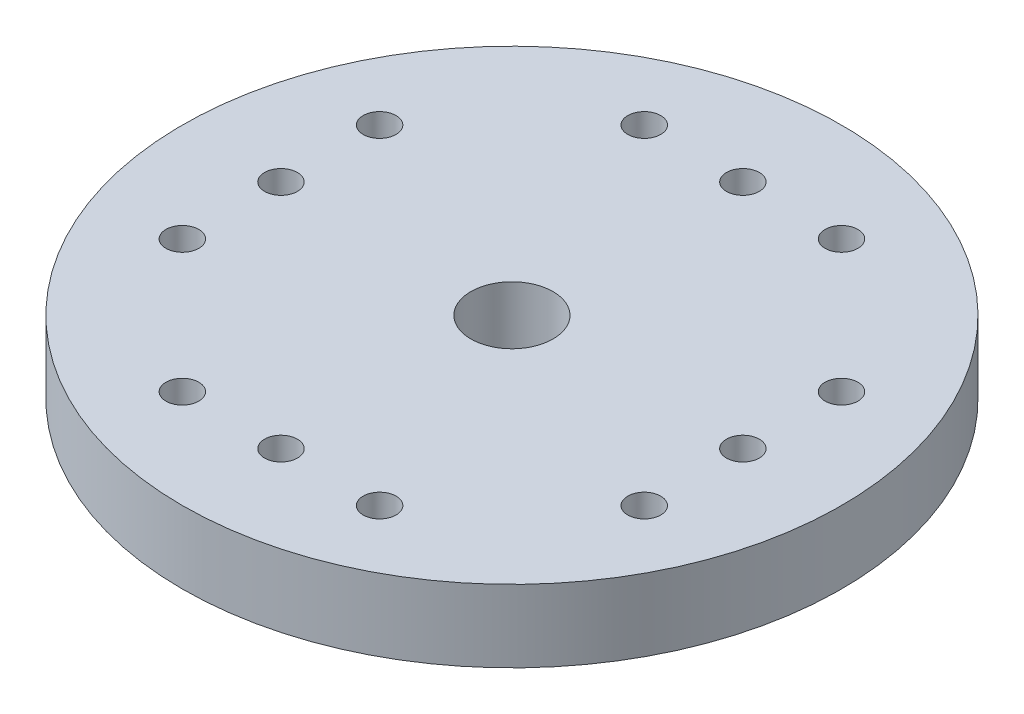
ISO-10303-21;
HEADER;
FILE_DESCRIPTION(('STEP AP214'),'2;1');
FILE_NAME('part.step','',(''),(''),'','','');
FILE_SCHEMA(('AUTOMOTIVE_DESIGN { 1 0 10303 214 1 1 1 1 }'));
ENDSEC;
DATA;
#1=APPLICATION_CONTEXT('core data for automotive mechanical design processes');
#2=APPLICATION_PROTOCOL_DEFINITION('international standard','automotive_design',2000,#1);
#3=PRODUCT_CONTEXT('',#1,'mechanical');
#4=PRODUCT('Part','Part','',(#3));
#5=PRODUCT_RELATED_PRODUCT_CATEGORY('part','',(#4));
#6=PRODUCT_DEFINITION_FORMATION('','',#4);
#7=PRODUCT_DEFINITION_CONTEXT('part definition',#1,'design');
#8=PRODUCT_DEFINITION('design','',#6,#7);
#9=PRODUCT_DEFINITION_SHAPE('','',#8);
#10=(LENGTH_UNIT() NAMED_UNIT(*) SI_UNIT(.MILLI.,.METRE.));
#11=(NAMED_UNIT(*) PLANE_ANGLE_UNIT() SI_UNIT($,.RADIAN.));
#12=(NAMED_UNIT(*) SI_UNIT($,.STERADIAN.) SOLID_ANGLE_UNIT());
#13=UNCERTAINTY_MEASURE_WITH_UNIT(LENGTH_MEASURE(1.E-05),#10,'distance_accuracy_value','');
#14=(GEOMETRIC_REPRESENTATION_CONTEXT(3) GLOBAL_UNCERTAINTY_ASSIGNED_CONTEXT((#13)) GLOBAL_UNIT_ASSIGNED_CONTEXT((#10,
#11,#12)) REPRESENTATION_CONTEXT('',''));
#15=CARTESIAN_POINT('',(0.,0.,0.));
#16=DIRECTION('',(0.,0.,1.));
#17=DIRECTION('',(1.,0.,0.));
#18=AXIS2_PLACEMENT_3D('',#15,#16,#17);
#19=CARTESIAN_POINT('',(0.,2.2,0.));
#20=DIRECTION('',(0.,-1.,0.));
#21=DIRECTION('',(0.,0.,-1.));
#22=AXIS2_PLACEMENT_3D('',#19,#20,#21);
#23=CYLINDRICAL_SURFACE('',#22,10.025);
#24=CARTESIAN_POINT('',(0.,2.2,0.));
#25=DIRECTION('',(0.,1.,0.));
#26=DIRECTION('',(0.,0.,1.));
#27=AXIS2_PLACEMENT_3D('',#24,#25,#26);
#28=CIRCLE('',#27,10.025);
#29=CARTESIAN_POINT('',(0.,2.2,10.025));
#30=VERTEX_POINT('',#29);
#31=EDGE_CURVE('E44',#30,#30,#28,.T.);
#32=ORIENTED_EDGE('',*,*,#31,.F.);
#33=EDGE_LOOP('',(#32));
#34=FACE_BOUND('',#33,.T.);
#35=CARTESIAN_POINT('',(0.,0.,0.));
#36=DIRECTION('',(0.,1.,0.));
#37=DIRECTION('',(0.,0.,1.));
#38=AXIS2_PLACEMENT_3D('',#35,#36,#37);
#39=CIRCLE('',#38,10.025);
#40=CARTESIAN_POINT('',(0.,0.,10.025));
#41=VERTEX_POINT('',#40);
#42=EDGE_CURVE('E48',#41,#41,#39,.T.);
#43=ORIENTED_EDGE('',*,*,#42,.T.);
#44=EDGE_LOOP('',(#43));
#45=FACE_BOUND('',#44,.T.);
#46=ADVANCED_FACE('F38',(#34,#45),#23,.T.);
#47=CARTESIAN_POINT('',(0.,2.2,0.));
#48=DIRECTION('',(0.,1.,0.));
#49=DIRECTION('',(0.,0.,1.));
#50=AXIS2_PLACEMENT_3D('',#47,#48,#49);
#51=PLANE('',#50);
#52=CARTESIAN_POINT('',(0.,2.2,0.));
#53=DIRECTION('',(0.,-1.,0.));
#54=DIRECTION('',(0.,0.,-1.));
#55=AXIS2_PLACEMENT_3D('',#52,#53,#54);
#56=CIRCLE('',#55,1.25);
#57=CARTESIAN_POINT('',(0.,2.2,-1.25));
#58=VERTEX_POINT('',#57);
#59=EDGE_CURVE('E133',#58,#58,#56,.T.);
#60=ORIENTED_EDGE('',*,*,#59,.T.);
#61=EDGE_LOOP('',(#60));
#62=FACE_BOUND('',#61,.T.);
#63=CARTESIAN_POINT('',(-3.00000000000007,2.2,-7.02499999999997));
#64=DIRECTION('',(0.,-1.,0.));
#65=DIRECTION('',(0.,0.,-1.));
#66=AXIS2_PLACEMENT_3D('',#63,#64,#65);
#67=CIRCLE('',#66,0.5);
#68=CARTESIAN_POINT('',(-3.00000000000007,2.2,-7.52499999999997));
#69=VERTEX_POINT('',#68);
#70=EDGE_CURVE('E64',#69,#69,#67,.T.);
#71=ORIENTED_EDGE('',*,*,#70,.T.);
#72=EDGE_LOOP('',(#71));
#73=FACE_BOUND('',#72,.T.);
#74=CARTESIAN_POINT('',(0.,2.2,-7.025));
#75=DIRECTION('',(0.,-1.,0.));
#76=DIRECTION('',(0.,0.,-1.));
#77=AXIS2_PLACEMENT_3D('',#74,#75,#76);
#78=CIRCLE('',#77,0.5);
#79=CARTESIAN_POINT('',(0.,2.2,-7.525));
#80=VERTEX_POINT('',#79);
#81=EDGE_CURVE('E71',#80,#80,#78,.T.);
#82=ORIENTED_EDGE('',*,*,#81,.T.);
#83=EDGE_LOOP('',(#82));
#84=FACE_BOUND('',#83,.T.);
#85=CARTESIAN_POINT('',(2.99999999999993,2.2,-7.02500000000003));
#86=DIRECTION('',(0.,-1.,0.));
#87=DIRECTION('',(0.,0.,-1.));
#88=AXIS2_PLACEMENT_3D('',#85,#86,#87);
#89=CIRCLE('',#88,0.5);
#90=CARTESIAN_POINT('',(2.99999999999993,2.2,-7.52500000000003));
#91=VERTEX_POINT('',#90);
#92=EDGE_CURVE('E77',#91,#91,#89,.T.);
#93=ORIENTED_EDGE('',*,*,#92,.T.);
#94=EDGE_LOOP('',(#93));
#95=FACE_BOUND('',#94,.T.);
#96=CARTESIAN_POINT('',(7.02499999999998,2.2,-3.00000000000005));
#97=DIRECTION('',(0.,-1.,0.));
#98=DIRECTION('',(0.,0.,-1.));
#99=AXIS2_PLACEMENT_3D('',#96,#97,#98);
#100=CIRCLE('',#99,0.500000000000001);
#101=CARTESIAN_POINT('',(7.02499999999998,2.2,-3.50000000000005));
#102=VERTEX_POINT('',#101);
#103=EDGE_CURVE('E83',#102,#102,#100,.T.);
#104=ORIENTED_EDGE('',*,*,#103,.T.);
#105=EDGE_LOOP('',(#104));
#106=FACE_BOUND('',#105,.T.);
#107=CARTESIAN_POINT('',(7.025,2.2,0.));
#108=DIRECTION('',(0.,-1.,0.));
#109=DIRECTION('',(0.,0.,-1.));
#110=AXIS2_PLACEMENT_3D('',#107,#108,#109);
#111=CIRCLE('',#110,0.5);
#112=CARTESIAN_POINT('',(7.025,2.2,-0.500000000000048));
#113=VERTEX_POINT('',#112);
#114=EDGE_CURVE('E89',#113,#113,#111,.T.);
#115=ORIENTED_EDGE('',*,*,#114,.T.);
#116=EDGE_LOOP('',(#115));
#117=FACE_BOUND('',#116,.T.);
#118=CARTESIAN_POINT('',(7.02500000000002,2.2,2.99999999999995));
#119=DIRECTION('',(0.,-1.,0.));
#120=DIRECTION('',(0.,0.,-1.));
#121=AXIS2_PLACEMENT_3D('',#118,#119,#120);
#122=CIRCLE('',#121,0.5);
#123=CARTESIAN_POINT('',(7.02500000000002,2.2,2.49999999999995));
#124=VERTEX_POINT('',#123);
#125=EDGE_CURVE('E95',#124,#124,#122,.T.);
#126=ORIENTED_EDGE('',*,*,#125,.T.);
#127=EDGE_LOOP('',(#126));
#128=FACE_BOUND('',#127,.T.);
#129=CARTESIAN_POINT('',(3.00000000000003,2.2,7.02499999999999));
#130=DIRECTION('',(0.,-1.,0.));
#131=DIRECTION('',(0.,0.,-1.));
#132=AXIS2_PLACEMENT_3D('',#129,#130,#131);
#133=CIRCLE('',#132,0.5);
#134=CARTESIAN_POINT('',(3.00000000000003,2.2,6.52499999999999));
#135=VERTEX_POINT('',#134);
#136=EDGE_CURVE('E101',#135,#135,#133,.T.);
#137=ORIENTED_EDGE('',*,*,#136,.T.);
#138=EDGE_LOOP('',(#137));
#139=FACE_BOUND('',#138,.T.);
#140=CARTESIAN_POINT('',(0.,2.2,7.025));
#141=DIRECTION('',(0.,-1.,0.));
#142=DIRECTION('',(0.,0.,-1.));
#143=AXIS2_PLACEMENT_3D('',#140,#141,#142);
#144=CIRCLE('',#143,0.5);
#145=CARTESIAN_POINT('',(0.,2.2,6.525));
#146=VERTEX_POINT('',#145);
#147=EDGE_CURVE('E107',#146,#146,#144,.T.);
#148=ORIENTED_EDGE('',*,*,#147,.T.);
#149=EDGE_LOOP('',(#148));
#150=FACE_BOUND('',#149,.T.);
#151=CARTESIAN_POINT('',(-2.99999999999998,2.2,7.02500000000001));
#152=DIRECTION('',(0.,-1.,0.));
#153=DIRECTION('',(0.,0.,-1.));
#154=AXIS2_PLACEMENT_3D('',#151,#152,#153);
#155=CIRCLE('',#154,0.5);
#156=CARTESIAN_POINT('',(-2.99999999999998,2.2,6.52500000000001));
#157=VERTEX_POINT('',#156);
#158=EDGE_CURVE('E113',#157,#157,#155,.T.);
#159=ORIENTED_EDGE('',*,*,#158,.T.);
#160=EDGE_LOOP('',(#159));
#161=FACE_BOUND('',#160,.T.);
#162=CARTESIAN_POINT('',(-7.025,2.2,3.));
#163=DIRECTION('',(0.,-1.,0.));
#164=DIRECTION('',(0.,0.,-1.));
#165=AXIS2_PLACEMENT_3D('',#162,#163,#164);
#166=CIRCLE('',#165,0.500000000000001);
#167=CARTESIAN_POINT('',(-7.025,2.2,2.5));
#168=VERTEX_POINT('',#167);
#169=EDGE_CURVE('E119',#168,#168,#166,.T.);
#170=ORIENTED_EDGE('',*,*,#169,.T.);
#171=EDGE_LOOP('',(#170));
#172=FACE_BOUND('',#171,.T.);
#173=CARTESIAN_POINT('',(-7.025,2.2,0.));
#174=DIRECTION('',(0.,-1.,0.));
#175=DIRECTION('',(0.,0.,-1.));
#176=AXIS2_PLACEMENT_3D('',#173,#174,#175);
#177=CIRCLE('',#176,0.5);
#178=CARTESIAN_POINT('',(-7.025,2.2,-0.5));
#179=VERTEX_POINT('',#178);
#180=EDGE_CURVE('E58',#179,#179,#177,.T.);
#181=ORIENTED_EDGE('',*,*,#180,.T.);
#182=EDGE_LOOP('',(#181));
#183=FACE_BOUND('',#182,.T.);
#184=CARTESIAN_POINT('',(-7.025,2.2,-3.));
#185=DIRECTION('',(0.,-1.,0.));
#186=DIRECTION('',(0.,0.,-1.));
#187=AXIS2_PLACEMENT_3D('',#184,#185,#186);
#188=CIRCLE('',#187,0.5);
#189=CARTESIAN_POINT('',(-7.025,2.2,-3.5));
#190=VERTEX_POINT('',#189);
#191=EDGE_CURVE('E53',#190,#190,#188,.T.);
#192=ORIENTED_EDGE('',*,*,#191,.T.);
#193=EDGE_LOOP('',(#192));
#194=FACE_BOUND('',#193,.T.);
#195=ORIENTED_EDGE('',*,*,#31,.T.);
#196=EDGE_LOOP('',(#195));
#197=FACE_BOUND('',#196,.T.);
#198=ADVANCED_FACE('F142',(#62,#73,#84,#95,#106,#117,#128,#139,#150,#161,#172,#183,#194,#197),
#51,.T.);
#199=CARTESIAN_POINT('',(0.,0.,0.));
#200=DIRECTION('',(0.,1.,0.));
#201=DIRECTION('',(0.,0.,1.));
#202=AXIS2_PLACEMENT_3D('',#199,#200,#201);
#203=PLANE('',#202);
#204=CARTESIAN_POINT('',(0.,0.,0.));
#205=DIRECTION('',(0.,1.,0.));
#206=DIRECTION('',(0.,0.,1.));
#207=AXIS2_PLACEMENT_3D('',#204,#205,#206);
#208=CIRCLE('',#207,3.8);
#209=CARTESIAN_POINT('',(0.,0.,3.8));
#210=VERTEX_POINT('',#209);
#211=EDGE_CURVE('E10',#210,#210,#208,.F.);
#212=ORIENTED_EDGE('',*,*,#211,.F.);
#213=EDGE_LOOP('',(#212));
#214=FACE_BOUND('',#213,.T.);
#215=CARTESIAN_POINT('',(-3.00000000000007,0.,-7.02499999999997));
#216=DIRECTION('',(0.,-1.,0.));
#217=DIRECTION('',(0.,0.,-1.));
#218=AXIS2_PLACEMENT_3D('',#215,#216,#217);
#219=CIRCLE('',#218,0.5);
#220=CARTESIAN_POINT('',(-3.00000000000007,0.,-7.52499999999997));
#221=VERTEX_POINT('',#220);
#222=EDGE_CURVE('E61',#221,#221,#219,.T.);
#223=ORIENTED_EDGE('',*,*,#222,.F.);
#224=EDGE_LOOP('',(#223));
#225=FACE_BOUND('',#224,.T.);
#226=CARTESIAN_POINT('',(0.,0.,-7.025));
#227=DIRECTION('',(0.,-1.,0.));
#228=DIRECTION('',(0.,0.,-1.));
#229=AXIS2_PLACEMENT_3D('',#226,#227,#228);
#230=CIRCLE('',#229,0.5);
#231=CARTESIAN_POINT('',(0.,0.,-7.525));
#232=VERTEX_POINT('',#231);
#233=EDGE_CURVE('E68',#232,#232,#230,.T.);
#234=ORIENTED_EDGE('',*,*,#233,.F.);
#235=EDGE_LOOP('',(#234));
#236=FACE_BOUND('',#235,.T.);
#237=CARTESIAN_POINT('',(2.99999999999993,0.,-7.02500000000003));
#238=DIRECTION('',(0.,-1.,0.));
#239=DIRECTION('',(0.,0.,-1.));
#240=AXIS2_PLACEMENT_3D('',#237,#238,#239);
#241=CIRCLE('',#240,0.5);
#242=CARTESIAN_POINT('',(2.99999999999993,0.,-7.52500000000003));
#243=VERTEX_POINT('',#242);
#244=EDGE_CURVE('E74',#243,#243,#241,.T.);
#245=ORIENTED_EDGE('',*,*,#244,.F.);
#246=EDGE_LOOP('',(#245));
#247=FACE_BOUND('',#246,.T.);
#248=CARTESIAN_POINT('',(7.02499999999998,0.,-3.00000000000005));
#249=DIRECTION('',(0.,-1.,0.));
#250=DIRECTION('',(0.,0.,-1.));
#251=AXIS2_PLACEMENT_3D('',#248,#249,#250);
#252=CIRCLE('',#251,0.500000000000001);
#253=CARTESIAN_POINT('',(7.02499999999998,0.,-3.50000000000005));
#254=VERTEX_POINT('',#253);
#255=EDGE_CURVE('E80',#254,#254,#252,.T.);
#256=ORIENTED_EDGE('',*,*,#255,.F.);
#257=EDGE_LOOP('',(#256));
#258=FACE_BOUND('',#257,.T.);
#259=CARTESIAN_POINT('',(7.025,0.,0.));
#260=DIRECTION('',(0.,-1.,0.));
#261=DIRECTION('',(0.,0.,-1.));
#262=AXIS2_PLACEMENT_3D('',#259,#260,#261);
#263=CIRCLE('',#262,0.5);
#264=CARTESIAN_POINT('',(7.025,0.,-0.500000000000048));
#265=VERTEX_POINT('',#264);
#266=EDGE_CURVE('E86',#265,#265,#263,.T.);
#267=ORIENTED_EDGE('',*,*,#266,.F.);
#268=EDGE_LOOP('',(#267));
#269=FACE_BOUND('',#268,.T.);
#270=CARTESIAN_POINT('',(7.02500000000002,0.,2.99999999999995));
#271=DIRECTION('',(0.,-1.,0.));
#272=DIRECTION('',(0.,0.,-1.));
#273=AXIS2_PLACEMENT_3D('',#270,#271,#272);
#274=CIRCLE('',#273,0.5);
#275=CARTESIAN_POINT('',(7.02500000000002,0.,2.49999999999995));
#276=VERTEX_POINT('',#275);
#277=EDGE_CURVE('E92',#276,#276,#274,.T.);
#278=ORIENTED_EDGE('',*,*,#277,.F.);
#279=EDGE_LOOP('',(#278));
#280=FACE_BOUND('',#279,.T.);
#281=CARTESIAN_POINT('',(3.00000000000003,0.,7.02499999999999));
#282=DIRECTION('',(0.,-1.,0.));
#283=DIRECTION('',(0.,0.,-1.));
#284=AXIS2_PLACEMENT_3D('',#281,#282,#283);
#285=CIRCLE('',#284,0.5);
#286=CARTESIAN_POINT('',(3.00000000000003,0.,6.52499999999999));
#287=VERTEX_POINT('',#286);
#288=EDGE_CURVE('E98',#287,#287,#285,.T.);
#289=ORIENTED_EDGE('',*,*,#288,.F.);
#290=EDGE_LOOP('',(#289));
#291=FACE_BOUND('',#290,.T.);
#292=CARTESIAN_POINT('',(0.,0.,7.025));
#293=DIRECTION('',(0.,-1.,0.));
#294=DIRECTION('',(0.,0.,-1.));
#295=AXIS2_PLACEMENT_3D('',#292,#293,#294);
#296=CIRCLE('',#295,0.5);
#297=CARTESIAN_POINT('',(0.,0.,6.525));
#298=VERTEX_POINT('',#297);
#299=EDGE_CURVE('E104',#298,#298,#296,.T.);
#300=ORIENTED_EDGE('',*,*,#299,.F.);
#301=EDGE_LOOP('',(#300));
#302=FACE_BOUND('',#301,.T.);
#303=CARTESIAN_POINT('',(-2.99999999999998,0.,7.02500000000001));
#304=DIRECTION('',(0.,-1.,0.));
#305=DIRECTION('',(0.,0.,-1.));
#306=AXIS2_PLACEMENT_3D('',#303,#304,#305);
#307=CIRCLE('',#306,0.5);
#308=CARTESIAN_POINT('',(-2.99999999999998,0.,6.52500000000001));
#309=VERTEX_POINT('',#308);
#310=EDGE_CURVE('E110',#309,#309,#307,.T.);
#311=ORIENTED_EDGE('',*,*,#310,.F.);
#312=EDGE_LOOP('',(#311));
#313=FACE_BOUND('',#312,.T.);
#314=CARTESIAN_POINT('',(-7.025,0.,3.));
#315=DIRECTION('',(0.,-1.,0.));
#316=DIRECTION('',(0.,0.,-1.));
#317=AXIS2_PLACEMENT_3D('',#314,#315,#316);
#318=CIRCLE('',#317,0.500000000000001);
#319=CARTESIAN_POINT('',(-7.025,0.,2.5));
#320=VERTEX_POINT('',#319);
#321=EDGE_CURVE('E116',#320,#320,#318,.T.);
#322=ORIENTED_EDGE('',*,*,#321,.F.);
#323=EDGE_LOOP('',(#322));
#324=FACE_BOUND('',#323,.T.);
#325=CARTESIAN_POINT('',(-7.025,0.,0.));
#326=DIRECTION('',(0.,-1.,0.));
#327=DIRECTION('',(0.,0.,-1.));
#328=AXIS2_PLACEMENT_3D('',#325,#326,#327);
#329=CIRCLE('',#328,0.5);
#330=CARTESIAN_POINT('',(-7.025,0.,-0.5));
#331=VERTEX_POINT('',#330);
#332=EDGE_CURVE('E122',#331,#331,#329,.T.);
#333=ORIENTED_EDGE('',*,*,#332,.F.);
#334=EDGE_LOOP('',(#333));
#335=FACE_BOUND('',#334,.T.);
#336=CARTESIAN_POINT('',(-7.025,0.,-3.));
#337=DIRECTION('',(0.,-1.,0.));
#338=DIRECTION('',(0.,0.,-1.));
#339=AXIS2_PLACEMENT_3D('',#336,#337,#338);
#340=CIRCLE('',#339,0.5);
#341=CARTESIAN_POINT('',(-7.025,0.,-3.5));
#342=VERTEX_POINT('',#341);
#343=EDGE_CURVE('E55',#342,#342,#340,.T.);
#344=ORIENTED_EDGE('',*,*,#343,.F.);
#345=EDGE_LOOP('',(#344));
#346=FACE_BOUND('',#345,.T.);
#347=ORIENTED_EDGE('',*,*,#42,.F.);
#348=EDGE_LOOP('',(#347));
#349=FACE_BOUND('',#348,.T.);
#350=ADVANCED_FACE('F185',(#214,#225,#236,#247,#258,#269,#280,#291,#302,#313,#324,#335,#346,
#349),#203,.F.);
#351=CARTESIAN_POINT('',(-7.025,2.2,-3.));
#352=DIRECTION('',(0.,-1.,0.));
#353=DIRECTION('',(0.,0.,-1.));
#354=AXIS2_PLACEMENT_3D('',#351,#352,#353);
#355=CYLINDRICAL_SURFACE('',#354,0.5);
#356=ORIENTED_EDGE('',*,*,#191,.F.);
#357=EDGE_LOOP('',(#356));
#358=FACE_BOUND('',#357,.T.);
#359=ORIENTED_EDGE('',*,*,#343,.T.);
#360=EDGE_LOOP('',(#359));
#361=FACE_BOUND('',#360,.T.);
#362=ADVANCED_FACE('F191',(#358,#361),#355,.F.);
#363=CARTESIAN_POINT('',(-7.025,2.2,0.));
#364=DIRECTION('',(0.,-1.,0.));
#365=DIRECTION('',(0.,0.,-1.));
#366=AXIS2_PLACEMENT_3D('',#363,#364,#365);
#367=CYLINDRICAL_SURFACE('',#366,0.5);
#368=ORIENTED_EDGE('',*,*,#180,.F.);
#369=EDGE_LOOP('',(#368));
#370=FACE_BOUND('',#369,.T.);
#371=ORIENTED_EDGE('',*,*,#332,.T.);
#372=EDGE_LOOP('',(#371));
#373=FACE_BOUND('',#372,.T.);
#374=ADVANCED_FACE('F196',(#370,#373),#367,.F.);
#375=CARTESIAN_POINT('',(-7.025,2.2,3.));
#376=DIRECTION('',(0.,-1.,0.));
#377=DIRECTION('',(0.,0.,-1.));
#378=AXIS2_PLACEMENT_3D('',#375,#376,#377);
#379=CYLINDRICAL_SURFACE('',#378,0.500000000000001);
#380=ORIENTED_EDGE('',*,*,#169,.F.);
#381=EDGE_LOOP('',(#380));
#382=FACE_BOUND('',#381,.T.);
#383=ORIENTED_EDGE('',*,*,#321,.T.);
#384=EDGE_LOOP('',(#383));
#385=FACE_BOUND('',#384,.T.);
#386=ADVANCED_FACE('F231',(#382,#385),#379,.F.);
#387=CARTESIAN_POINT('',(-2.99999999999998,2.2,7.02500000000001));
#388=DIRECTION('',(0.,-1.,0.));
#389=DIRECTION('',(0.,0.,-1.));
#390=AXIS2_PLACEMENT_3D('',#387,#388,#389);
#391=CYLINDRICAL_SURFACE('',#390,0.5);
#392=ORIENTED_EDGE('',*,*,#158,.F.);
#393=EDGE_LOOP('',(#392));
#394=FACE_BOUND('',#393,.T.);
#395=ORIENTED_EDGE('',*,*,#310,.T.);
#396=EDGE_LOOP('',(#395));
#397=FACE_BOUND('',#396,.T.);
#398=ADVANCED_FACE('F227',(#394,#397),#391,.F.);
#399=CARTESIAN_POINT('',(0.,2.2,7.025));
#400=DIRECTION('',(0.,-1.,0.));
#401=DIRECTION('',(0.,0.,-1.));
#402=AXIS2_PLACEMENT_3D('',#399,#400,#401);
#403=CYLINDRICAL_SURFACE('',#402,0.5);
#404=ORIENTED_EDGE('',*,*,#147,.F.);
#405=EDGE_LOOP('',(#404));
#406=FACE_BOUND('',#405,.T.);
#407=ORIENTED_EDGE('',*,*,#299,.T.);
#408=EDGE_LOOP('',(#407));
#409=FACE_BOUND('',#408,.T.);
#410=ADVANCED_FACE('F223',(#406,#409),#403,.F.);
#411=CARTESIAN_POINT('',(3.00000000000003,2.2,7.02499999999999));
#412=DIRECTION('',(0.,-1.,0.));
#413=DIRECTION('',(0.,0.,-1.));
#414=AXIS2_PLACEMENT_3D('',#411,#412,#413);
#415=CYLINDRICAL_SURFACE('',#414,0.5);
#416=ORIENTED_EDGE('',*,*,#136,.F.);
#417=EDGE_LOOP('',(#416));
#418=FACE_BOUND('',#417,.T.);
#419=ORIENTED_EDGE('',*,*,#288,.T.);
#420=EDGE_LOOP('',(#419));
#421=FACE_BOUND('',#420,.T.);
#422=ADVANCED_FACE('F219',(#418,#421),#415,.F.);
#423=CARTESIAN_POINT('',(7.02500000000002,2.2,2.99999999999995));
#424=DIRECTION('',(0.,-1.,0.));
#425=DIRECTION('',(0.,0.,-1.));
#426=AXIS2_PLACEMENT_3D('',#423,#424,#425);
#427=CYLINDRICAL_SURFACE('',#426,0.5);
#428=ORIENTED_EDGE('',*,*,#125,.F.);
#429=EDGE_LOOP('',(#428));
#430=FACE_BOUND('',#429,.T.);
#431=ORIENTED_EDGE('',*,*,#277,.T.);
#432=EDGE_LOOP('',(#431));
#433=FACE_BOUND('',#432,.T.);
#434=ADVANCED_FACE('F215',(#430,#433),#427,.F.);
#435=CARTESIAN_POINT('',(7.025,2.2,0.));
#436=DIRECTION('',(0.,-1.,0.));
#437=DIRECTION('',(0.,0.,-1.));
#438=AXIS2_PLACEMENT_3D('',#435,#436,#437);
#439=CYLINDRICAL_SURFACE('',#438,0.5);
#440=ORIENTED_EDGE('',*,*,#114,.F.);
#441=EDGE_LOOP('',(#440));
#442=FACE_BOUND('',#441,.T.);
#443=ORIENTED_EDGE('',*,*,#266,.T.);
#444=EDGE_LOOP('',(#443));
#445=FACE_BOUND('',#444,.T.);
#446=ADVANCED_FACE('F211',(#442,#445),#439,.F.);
#447=CARTESIAN_POINT('',(7.02499999999998,2.2,-3.00000000000005));
#448=DIRECTION('',(0.,-1.,0.));
#449=DIRECTION('',(0.,0.,-1.));
#450=AXIS2_PLACEMENT_3D('',#447,#448,#449);
#451=CYLINDRICAL_SURFACE('',#450,0.500000000000001);
#452=ORIENTED_EDGE('',*,*,#103,.F.);
#453=EDGE_LOOP('',(#452));
#454=FACE_BOUND('',#453,.T.);
#455=ORIENTED_EDGE('',*,*,#255,.T.);
#456=EDGE_LOOP('',(#455));
#457=FACE_BOUND('',#456,.T.);
#458=ADVANCED_FACE('F207',(#454,#457),#451,.F.);
#459=CARTESIAN_POINT('',(2.99999999999993,2.2,-7.02500000000003));
#460=DIRECTION('',(0.,-1.,0.));
#461=DIRECTION('',(0.,0.,-1.));
#462=AXIS2_PLACEMENT_3D('',#459,#460,#461);
#463=CYLINDRICAL_SURFACE('',#462,0.5);
#464=ORIENTED_EDGE('',*,*,#92,.F.);
#465=EDGE_LOOP('',(#464));
#466=FACE_BOUND('',#465,.T.);
#467=ORIENTED_EDGE('',*,*,#244,.T.);
#468=EDGE_LOOP('',(#467));
#469=FACE_BOUND('',#468,.T.);
#470=ADVANCED_FACE('F203',(#466,#469),#463,.F.);
#471=CARTESIAN_POINT('',(0.,2.2,-7.025));
#472=DIRECTION('',(0.,-1.,0.));
#473=DIRECTION('',(0.,0.,-1.));
#474=AXIS2_PLACEMENT_3D('',#471,#472,#473);
#475=CYLINDRICAL_SURFACE('',#474,0.5);
#476=ORIENTED_EDGE('',*,*,#81,.F.);
#477=EDGE_LOOP('',(#476));
#478=FACE_BOUND('',#477,.T.);
#479=ORIENTED_EDGE('',*,*,#233,.T.);
#480=EDGE_LOOP('',(#479));
#481=FACE_BOUND('',#480,.T.);
#482=ADVANCED_FACE('F176',(#478,#481),#475,.F.);
#483=CARTESIAN_POINT('',(-3.00000000000007,2.2,-7.02499999999997));
#484=DIRECTION('',(0.,-1.,0.));
#485=DIRECTION('',(0.,0.,-1.));
#486=AXIS2_PLACEMENT_3D('',#483,#484,#485);
#487=CYLINDRICAL_SURFACE('',#486,0.5);
#488=ORIENTED_EDGE('',*,*,#70,.F.);
#489=EDGE_LOOP('',(#488));
#490=FACE_BOUND('',#489,.T.);
#491=ORIENTED_EDGE('',*,*,#222,.T.);
#492=EDGE_LOOP('',(#491));
#493=FACE_BOUND('',#492,.T.);
#494=ADVANCED_FACE('F171',(#490,#493),#487,.F.);
#495=CARTESIAN_POINT('',(0.,-3.4,0.));
#496=DIRECTION('',(0.,1.,0.));
#497=DIRECTION('',(0.,0.,1.));
#498=AXIS2_PLACEMENT_3D('',#495,#496,#497);
#499=CYLINDRICAL_SURFACE('',#498,3.8);
#500=CARTESIAN_POINT('',(0.,-3.4,0.));
#501=DIRECTION('',(0.,-1.,0.));
#502=DIRECTION('',(0.,0.,-1.));
#503=AXIS2_PLACEMENT_3D('',#500,#501,#502);
#504=CIRCLE('',#503,3.8);
#505=CARTESIAN_POINT('',(0.,-3.4,-3.8));
#506=VERTEX_POINT('',#505);
#507=EDGE_CURVE('E65',#506,#506,#504,.T.);
#508=ORIENTED_EDGE('',*,*,#507,.F.);
#509=EDGE_LOOP('',(#508));
#510=FACE_BOUND('',#509,.T.);
#511=ORIENTED_EDGE('',*,*,#211,.T.);
#512=EDGE_LOOP('',(#511));
#513=FACE_BOUND('',#512,.T.);
#514=ADVANCED_FACE('F166',(#510,#513),#499,.T.);
#515=CARTESIAN_POINT('',(0.,-3.4,0.));
#516=DIRECTION('',(0.,-1.,0.));
#517=DIRECTION('',(0.,0.,-1.));
#518=AXIS2_PLACEMENT_3D('',#515,#516,#517);
#519=PLANE('',#518);
#520=CARTESIAN_POINT('',(0.,-3.4,0.));
#521=DIRECTION('',(0.,-1.,0.));
#522=DIRECTION('',(0.,0.,-1.));
#523=AXIS2_PLACEMENT_3D('',#520,#521,#522);
#524=CIRCLE('',#523,3.);
#525=CARTESIAN_POINT('',(0.,-3.4,-3.));
#526=VERTEX_POINT('',#525);
#527=EDGE_CURVE('E130',#526,#526,#524,.T.);
#528=ORIENTED_EDGE('',*,*,#527,.F.);
#529=EDGE_LOOP('',(#528));
#530=FACE_BOUND('',#529,.T.);
#531=ORIENTED_EDGE('',*,*,#507,.T.);
#532=EDGE_LOOP('',(#531));
#533=FACE_BOUND('',#532,.T.);
#534=ADVANCED_FACE('F160',(#530,#533),#519,.T.);
#535=CARTESIAN_POINT('',(0.,-0.6,0.));
#536=DIRECTION('',(0.,-1.,0.));
#537=DIRECTION('',(0.,0.,-1.));
#538=AXIS2_PLACEMENT_3D('',#535,#536,#537);
#539=CYLINDRICAL_SURFACE('',#538,3.);
#540=CARTESIAN_POINT('',(0.,-0.6,0.));
#541=DIRECTION('',(0.,-1.,0.));
#542=DIRECTION('',(0.,0.,-1.));
#543=AXIS2_PLACEMENT_3D('',#540,#541,#542);
#544=CIRCLE('',#543,3.);
#545=CARTESIAN_POINT('',(0.,-0.6,-3.));
#546=VERTEX_POINT('',#545);
#547=EDGE_CURVE('E129',#546,#546,#544,.T.);
#548=ORIENTED_EDGE('',*,*,#547,.F.);
#549=EDGE_LOOP('',(#548));
#550=FACE_BOUND('',#549,.T.);
#551=ORIENTED_EDGE('',*,*,#527,.T.);
#552=EDGE_LOOP('',(#551));
#553=FACE_BOUND('',#552,.T.);
#554=ADVANCED_FACE('F154',(#550,#553),#539,.F.);
#555=CARTESIAN_POINT('',(0.,-0.6,0.));
#556=DIRECTION('',(0.,-1.,0.));
#557=DIRECTION('',(0.,0.,-1.));
#558=AXIS2_PLACEMENT_3D('',#555,#556,#557);
#559=PLANE('',#558);
#560=CARTESIAN_POINT('',(0.,-0.6,0.));
#561=DIRECTION('',(0.,-1.,0.));
#562=DIRECTION('',(0.,0.,-1.));
#563=AXIS2_PLACEMENT_3D('',#560,#561,#562);
#564=CIRCLE('',#563,1.25);
#565=CARTESIAN_POINT('',(0.,-0.6,-1.25));
#566=VERTEX_POINT('',#565);
#567=EDGE_CURVE('E136',#566,#566,#564,.T.);
#568=ORIENTED_EDGE('',*,*,#567,.F.);
#569=EDGE_LOOP('',(#568));
#570=FACE_BOUND('',#569,.T.);
#571=ORIENTED_EDGE('',*,*,#547,.T.);
#572=EDGE_LOOP('',(#571));
#573=FACE_BOUND('',#572,.T.);
#574=ADVANCED_FACE('F148',(#570,#573),#559,.T.);
#575=CARTESIAN_POINT('',(0.,2.2,0.));
#576=DIRECTION('',(0.,-1.,0.));
#577=DIRECTION('',(0.,0.,-1.));
#578=AXIS2_PLACEMENT_3D('',#575,#576,#577);
#579=CYLINDRICAL_SURFACE('',#578,1.25);
#580=ORIENTED_EDGE('',*,*,#59,.F.);
#581=EDGE_LOOP('',(#580));
#582=FACE_BOUND('',#581,.T.);
#583=ORIENTED_EDGE('',*,*,#567,.T.);
#584=EDGE_LOOP('',(#583));
#585=FACE_BOUND('',#584,.T.);
#586=ADVANCED_FACE('F145',(#582,#585),#579,.F.);
#587=CLOSED_SHELL('',(#46,#198,#350,#362,#374,#386,#398,#410,#422,#434,#446,#458,#470,#482,#494,
#514,#534,#554,#574,#586));
#588=MANIFOLD_SOLID_BREP('B2',#587);
#589=ADVANCED_BREP_SHAPE_REPRESENTATION('',(#18,#588),#14);
#590=SHAPE_DEFINITION_REPRESENTATION(#9,#589);
ENDSEC;
END-ISO-10303-21;
